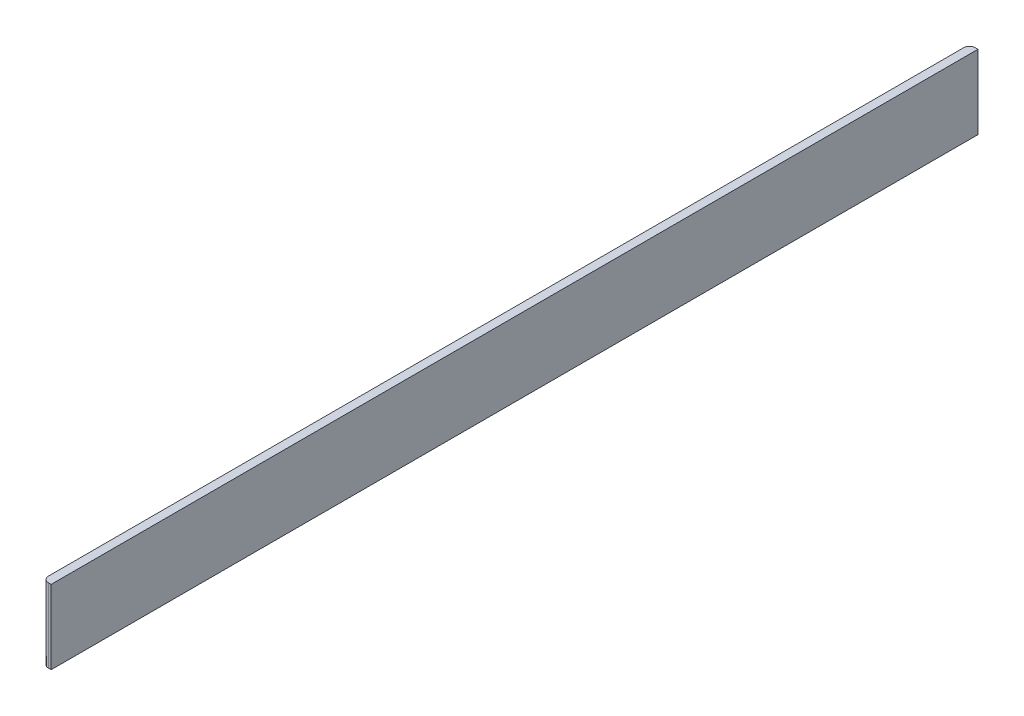
ISO-10303-21;
HEADER;
FILE_DESCRIPTION(('STEP AP214'),'2;1');
FILE_NAME('part.step','',(''),(''),'','','');
FILE_SCHEMA(('AUTOMOTIVE_DESIGN { 1 0 10303 214 1 1 1 1 }'));
ENDSEC;
DATA;
#1=APPLICATION_CONTEXT('core data for automotive mechanical design processes');
#2=APPLICATION_PROTOCOL_DEFINITION('international standard','automotive_design',2000,#1);
#3=PRODUCT_CONTEXT('',#1,'mechanical');
#4=PRODUCT('Part','Part','',(#3));
#5=PRODUCT_RELATED_PRODUCT_CATEGORY('part','',(#4));
#6=PRODUCT_DEFINITION_FORMATION('','',#4);
#7=PRODUCT_DEFINITION_CONTEXT('part definition',#1,'design');
#8=PRODUCT_DEFINITION('design','',#6,#7);
#9=PRODUCT_DEFINITION_SHAPE('','',#8);
#10=(LENGTH_UNIT() NAMED_UNIT(*) SI_UNIT(.MILLI.,.METRE.));
#11=(NAMED_UNIT(*) PLANE_ANGLE_UNIT() SI_UNIT($,.RADIAN.));
#12=(NAMED_UNIT(*) SI_UNIT($,.STERADIAN.) SOLID_ANGLE_UNIT());
#13=UNCERTAINTY_MEASURE_WITH_UNIT(LENGTH_MEASURE(1.E-05),#10,'distance_accuracy_value','');
#14=(GEOMETRIC_REPRESENTATION_CONTEXT(3) GLOBAL_UNCERTAINTY_ASSIGNED_CONTEXT((#13)) GLOBAL_UNIT_ASSIGNED_CONTEXT((#10,
#11,#12)) REPRESENTATION_CONTEXT('',''));
#15=CARTESIAN_POINT('',(0.,0.,0.));
#16=DIRECTION('',(0.,0.,1.));
#17=DIRECTION('',(1.,0.,0.));
#18=AXIS2_PLACEMENT_3D('',#15,#16,#17);
#19=CARTESIAN_POINT('',(-508.,2146.38765151858,0.));
#20=DIRECTION('',(1.,0.,0.));
#21=DIRECTION('',(0.,0.,-1.));
#22=AXIS2_PLACEMENT_3D('',#19,#20,#21);
#23=PLANE('',#22);
#24=DIRECTION('',(0.,-1.,0.));
#25=VECTOR('',#24,1.);
#26=CARTESIAN_POINT('',(-508.,2146.38765151858,-1035.05));
#27=LINE('',#26,#25);
#28=CARTESIAN_POINT('',(-508.,76.2,-1035.05));
#29=VERTEX_POINT('',#28);
#30=CARTESIAN_POINT('',(-508.,-88.9000000000002,-1035.05));
#31=VERTEX_POINT('',#30);
#32=EDGE_CURVE('E122',#29,#31,#27,.T.);
#33=ORIENTED_EDGE('',*,*,#32,.F.);
#34=DIRECTION('',(0.,0.,1.));
#35=VECTOR('',#34,1.);
#36=CARTESIAN_POINT('',(-508.,76.2,0.));
#37=LINE('',#36,#35);
#38=CARTESIAN_POINT('',(-508.,76.2,1035.05));
#39=VERTEX_POINT('',#38);
#40=EDGE_CURVE('E99',#29,#39,#37,.T.);
#41=ORIENTED_EDGE('',*,*,#40,.T.);
#42=DIRECTION('',(0.,-1.,0.));
#43=VECTOR('',#42,1.);
#44=CARTESIAN_POINT('',(-508.,2146.38765151858,1035.05));
#45=LINE('',#44,#43);
#46=CARTESIAN_POINT('',(-508.,-88.9000000000002,1035.05));
#47=VERTEX_POINT('',#46);
#48=EDGE_CURVE('E94',#39,#47,#45,.T.);
#49=ORIENTED_EDGE('',*,*,#48,.T.);
#50=DIRECTION('',(0.,0.,-1.));
#51=VECTOR('',#50,1.);
#52=CARTESIAN_POINT('',(-508.,-88.9000000000002,0.));
#53=LINE('',#52,#51);
#54=EDGE_CURVE('E97',#47,#31,#53,.T.);
#55=ORIENTED_EDGE('',*,*,#54,.T.);
#56=EDGE_LOOP('',(#33,#41,#49,#55));
#57=FACE_BOUND('',#56,.T.);
#58=ADVANCED_FACE('F38',(#57),#23,.T.);
#59=CARTESIAN_POINT('',(0.,2146.38765151858,-1035.05));
#60=DIRECTION('',(0.,0.,-1.));
#61=DIRECTION('',(-1.,0.,0.));
#62=AXIS2_PLACEMENT_3D('',#59,#60,#61);
#63=PLANE('',#62);
#64=DIRECTION('',(-1.,0.,0.));
#65=VECTOR('',#64,1.);
#66=CARTESIAN_POINT('',(0.,-88.9000000000002,-1035.05));
#67=LINE('',#66,#65);
#68=CARTESIAN_POINT('',(-514.35,-88.9000000000002,-1035.05));
#69=VERTEX_POINT('',#68);
#70=EDGE_CURVE('E110',#31,#69,#67,.T.);
#71=ORIENTED_EDGE('',*,*,#70,.T.);
#72=DIRECTION('',(0.,-1.,0.));
#73=VECTOR('',#72,1.);
#74=CARTESIAN_POINT('',(-514.35,76.2,-1035.05));
#75=LINE('',#74,#73);
#76=CARTESIAN_POINT('',(-514.35,76.2,-1035.05));
#77=VERTEX_POINT('',#76);
#78=EDGE_CURVE('E61',#69,#77,#75,.F.);
#79=ORIENTED_EDGE('',*,*,#78,.T.);
#80=DIRECTION('',(1.,0.,0.));
#81=VECTOR('',#80,1.);
#82=CARTESIAN_POINT('',(0.,76.2,-1035.05));
#83=LINE('',#82,#81);
#84=EDGE_CURVE('E102',#77,#29,#83,.T.);
#85=ORIENTED_EDGE('',*,*,#84,.T.);
#86=ORIENTED_EDGE('',*,*,#32,.T.);
#87=EDGE_LOOP('',(#71,#79,#85,#86));
#88=FACE_BOUND('',#87,.T.);
#89=ADVANCED_FACE('F147',(#88),#63,.T.);
#90=CARTESIAN_POINT('',(-527.05,2146.38765151858,0.));
#91=DIRECTION('',(1.,0.,0.));
#92=DIRECTION('',(0.,0.,-1.));
#93=AXIS2_PLACEMENT_3D('',#90,#91,#92);
#94=PLANE('',#93);
#95=DIRECTION('',(0.,0.,1.));
#96=VECTOR('',#95,1.);
#97=CARTESIAN_POINT('',(-527.05,76.2,0.));
#98=LINE('',#97,#96);
#99=CARTESIAN_POINT('',(-527.05,76.2,-1022.35));
#100=VERTEX_POINT('',#99);
#101=CARTESIAN_POINT('',(-527.05,76.2,1022.35));
#102=VERTEX_POINT('',#101);
#103=EDGE_CURVE('E119',#100,#102,#98,.T.);
#104=ORIENTED_EDGE('',*,*,#103,.F.);
#105=DIRECTION('',(0.,-1.,0.));
#106=VECTOR('',#105,1.);
#107=CARTESIAN_POINT('',(-527.05,-88.9000000000002,-1022.35));
#108=LINE('',#107,#106);
#109=CARTESIAN_POINT('',(-527.05,-88.9000000000002,-1022.35));
#110=VERTEX_POINT('',#109);
#111=EDGE_CURVE('E129',#100,#110,#108,.T.);
#112=ORIENTED_EDGE('',*,*,#111,.T.);
#113=DIRECTION('',(0.,0.,-1.));
#114=VECTOR('',#113,1.);
#115=CARTESIAN_POINT('',(-527.05,-88.9000000000002,0.));
#116=LINE('',#115,#114);
#117=CARTESIAN_POINT('',(-527.05,-88.9000000000002,1022.35));
#118=VERTEX_POINT('',#117);
#119=EDGE_CURVE('E114',#118,#110,#116,.T.);
#120=ORIENTED_EDGE('',*,*,#119,.F.);
#121=DIRECTION('',(0.,-1.,0.));
#122=VECTOR('',#121,1.);
#123=CARTESIAN_POINT('',(-527.05,2146.38765151858,1022.35));
#124=LINE('',#123,#122);
#125=EDGE_CURVE('E126',#118,#102,#124,.F.);
#126=ORIENTED_EDGE('',*,*,#125,.T.);
#127=EDGE_LOOP('',(#104,#112,#120,#126));
#128=FACE_BOUND('',#127,.T.);
#129=ADVANCED_FACE('F143',(#128),#94,.F.);
#130=CARTESIAN_POINT('',(0.,2146.38765151858,1035.05));
#131=DIRECTION('',(0.,0.,-1.));
#132=DIRECTION('',(-1.,0.,0.));
#133=AXIS2_PLACEMENT_3D('',#130,#131,#132);
#134=PLANE('',#133);
#135=DIRECTION('',(1.,0.,0.));
#136=VECTOR('',#135,1.);
#137=CARTESIAN_POINT('',(0.,76.2,1035.05));
#138=LINE('',#137,#136);
#139=CARTESIAN_POINT('',(-514.35,76.2,1035.05));
#140=VERTEX_POINT('',#139);
#141=EDGE_CURVE('E121',#140,#39,#138,.T.);
#142=ORIENTED_EDGE('',*,*,#141,.F.);
#143=DIRECTION('',(0.,-1.,0.));
#144=VECTOR('',#143,1.);
#145=CARTESIAN_POINT('',(-514.35,2146.38765151858,1035.05));
#146=LINE('',#145,#144);
#147=CARTESIAN_POINT('',(-514.35,-88.9000000000002,1035.05));
#148=VERTEX_POINT('',#147);
#149=EDGE_CURVE('E11',#140,#148,#146,.T.);
#150=ORIENTED_EDGE('',*,*,#149,.T.);
#151=DIRECTION('',(-1.,0.,0.));
#152=VECTOR('',#151,1.);
#153=CARTESIAN_POINT('',(0.,-88.9000000000002,1035.05));
#154=LINE('',#153,#152);
#155=EDGE_CURVE('E109',#47,#148,#154,.T.);
#156=ORIENTED_EDGE('',*,*,#155,.F.);
#157=ORIENTED_EDGE('',*,*,#48,.F.);
#158=EDGE_LOOP('',(#142,#150,#156,#157));
#159=FACE_BOUND('',#158,.T.);
#160=ADVANCED_FACE('F112',(#159),#134,.F.);
#161=CARTESIAN_POINT('',(0.,-88.9,0.));
#162=DIRECTION('',(0.,1.,0.));
#163=DIRECTION('',(0.,0.,1.));
#164=AXIS2_PLACEMENT_3D('',#161,#162,#163);
#165=PLANE('',#164);
#166=ORIENTED_EDGE('',*,*,#119,.T.);
#167=CARTESIAN_POINT('',(-514.35,-88.9000000000002,-1022.35));
#168=DIRECTION('',(0.,1.,0.));
#169=DIRECTION('',(0.,0.,1.));
#170=AXIS2_PLACEMENT_3D('',#167,#168,#169);
#171=CIRCLE('',#170,12.7);
#172=EDGE_CURVE('E134',#110,#69,#171,.F.);
#173=ORIENTED_EDGE('',*,*,#172,.T.);
#174=ORIENTED_EDGE('',*,*,#70,.F.);
#175=ORIENTED_EDGE('',*,*,#54,.F.);
#176=ORIENTED_EDGE('',*,*,#155,.T.);
#177=CARTESIAN_POINT('',(-514.35,-88.9000000000002,1022.35));
#178=DIRECTION('',(0.,1.,0.));
#179=DIRECTION('',(0.,0.,1.));
#180=AXIS2_PLACEMENT_3D('',#177,#178,#179);
#181=CIRCLE('',#180,12.7);
#182=EDGE_CURVE('E132',#148,#118,#181,.F.);
#183=ORIENTED_EDGE('',*,*,#182,.T.);
#184=EDGE_LOOP('',(#166,#173,#174,#175,#176,#183));
#185=FACE_BOUND('',#184,.T.);
#186=ADVANCED_FACE('F108',(#185),#165,.F.);
#187=CARTESIAN_POINT('',(-514.35,2146.38765151858,-1022.35));
#188=DIRECTION('',(0.,1.,0.));
#189=DIRECTION('',(0.,0.,1.));
#190=AXIS2_PLACEMENT_3D('',#187,#188,#189);
#191=CYLINDRICAL_SURFACE('',#190,12.7);
#192=CARTESIAN_POINT('',(-514.35,76.2,-1022.35));
#193=DIRECTION('',(0.,1.,0.));
#194=DIRECTION('',(0.,0.,1.));
#195=AXIS2_PLACEMENT_3D('',#192,#193,#194);
#196=CIRCLE('',#195,12.7);
#197=EDGE_CURVE('E46',#77,#100,#196,.T.);
#198=ORIENTED_EDGE('',*,*,#197,.F.);
#199=ORIENTED_EDGE('',*,*,#78,.F.);
#200=ORIENTED_EDGE('',*,*,#172,.F.);
#201=ORIENTED_EDGE('',*,*,#111,.F.);
#202=EDGE_LOOP('',(#198,#199,#200,#201));
#203=FACE_BOUND('',#202,.T.);
#204=ADVANCED_FACE('F146',(#203),#191,.T.);
#205=CARTESIAN_POINT('',(-514.35,2146.38765151858,1022.35));
#206=DIRECTION('',(0.,-1.,0.));
#207=DIRECTION('',(0.,0.,-1.));
#208=AXIS2_PLACEMENT_3D('',#205,#206,#207);
#209=CYLINDRICAL_SURFACE('',#208,12.7);
#210=CARTESIAN_POINT('',(-514.35,76.2,1022.35));
#211=DIRECTION('',(0.,1.,0.));
#212=DIRECTION('',(0.,0.,1.));
#213=AXIS2_PLACEMENT_3D('',#210,#211,#212);
#214=CIRCLE('',#213,12.7);
#215=EDGE_CURVE('E53',#102,#140,#214,.T.);
#216=ORIENTED_EDGE('',*,*,#215,.F.);
#217=ORIENTED_EDGE('',*,*,#125,.F.);
#218=ORIENTED_EDGE('',*,*,#182,.F.);
#219=ORIENTED_EDGE('',*,*,#149,.F.);
#220=EDGE_LOOP('',(#216,#217,#218,#219));
#221=FACE_BOUND('',#220,.T.);
#222=ADVANCED_FACE('F40',(#221),#209,.T.);
#223=CARTESIAN_POINT('',(0.,76.2,0.));
#224=DIRECTION('',(0.,1.,0.));
#225=DIRECTION('',(0.,0.,1.));
#226=AXIS2_PLACEMENT_3D('',#223,#224,#225);
#227=PLANE('',#226);
#228=ORIENTED_EDGE('',*,*,#84,.F.);
#229=ORIENTED_EDGE('',*,*,#197,.T.);
#230=ORIENTED_EDGE('',*,*,#103,.T.);
#231=ORIENTED_EDGE('',*,*,#215,.T.);
#232=ORIENTED_EDGE('',*,*,#141,.T.);
#233=ORIENTED_EDGE('',*,*,#40,.F.);
#234=EDGE_LOOP('',(#228,#229,#230,#231,#232,#233));
#235=FACE_BOUND('',#234,.T.);
#236=ADVANCED_FACE('F139',(#235),#227,.T.);
#237=CLOSED_SHELL('',(#58,#89,#129,#160,#186,#204,#222,#236));
#238=MANIFOLD_SOLID_BREP('B2',#237);
#239=ADVANCED_BREP_SHAPE_REPRESENTATION('',(#18,#238),#14);
#240=SHAPE_DEFINITION_REPRESENTATION(#9,#239);
ENDSEC;
END-ISO-10303-21;
